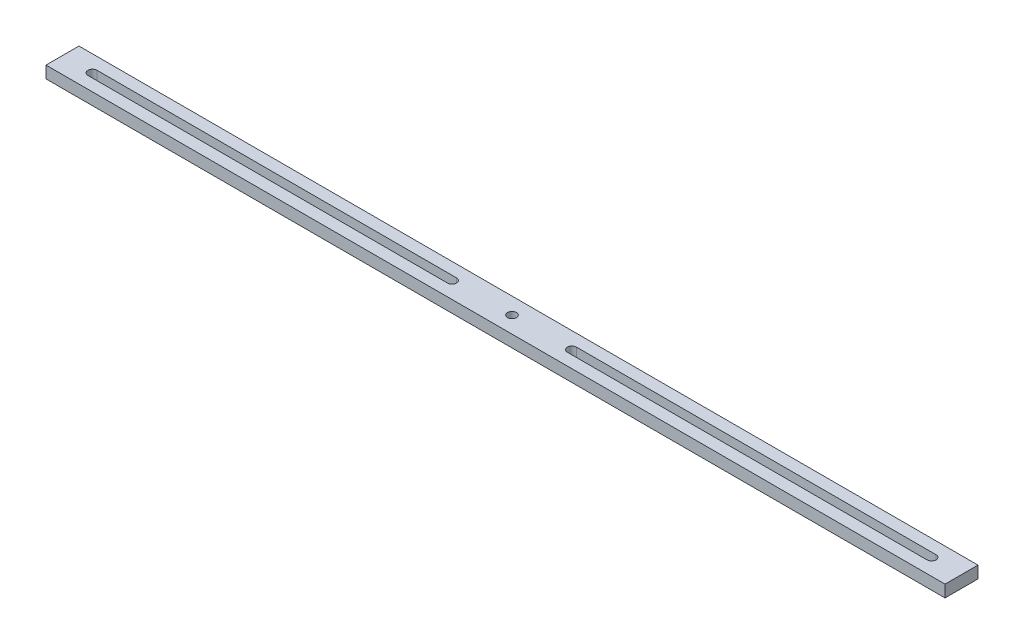
ISO-10303-21;
HEADER;
FILE_DESCRIPTION(('STEP AP214'),'2;1');
FILE_NAME('part.step','',(''),(''),'','','');
FILE_SCHEMA(('AUTOMOTIVE_DESIGN { 1 0 10303 214 1 1 1 1 }'));
ENDSEC;
DATA;
#1=APPLICATION_CONTEXT('core data for automotive mechanical design processes');
#2=APPLICATION_PROTOCOL_DEFINITION('international standard','automotive_design',2000,#1);
#3=PRODUCT_CONTEXT('',#1,'mechanical');
#4=PRODUCT('Part','Part','',(#3));
#5=PRODUCT_RELATED_PRODUCT_CATEGORY('part','',(#4));
#6=PRODUCT_DEFINITION_FORMATION('','',#4);
#7=PRODUCT_DEFINITION_CONTEXT('part definition',#1,'design');
#8=PRODUCT_DEFINITION('design','',#6,#7);
#9=PRODUCT_DEFINITION_SHAPE('','',#8);
#10=(LENGTH_UNIT() NAMED_UNIT(*) SI_UNIT(.MILLI.,.METRE.));
#11=(NAMED_UNIT(*) PLANE_ANGLE_UNIT() SI_UNIT($,.RADIAN.));
#12=(NAMED_UNIT(*) SI_UNIT($,.STERADIAN.) SOLID_ANGLE_UNIT());
#13=UNCERTAINTY_MEASURE_WITH_UNIT(LENGTH_MEASURE(1.E-05),#10,'distance_accuracy_value','');
#14=(GEOMETRIC_REPRESENTATION_CONTEXT(3) GLOBAL_UNCERTAINTY_ASSIGNED_CONTEXT((#13)) GLOBAL_UNIT_ASSIGNED_CONTEXT((#10,
#11,#12)) REPRESENTATION_CONTEXT('',''));
#15=CARTESIAN_POINT('',(0.,0.,0.));
#16=DIRECTION('',(0.,0.,1.));
#17=DIRECTION('',(1.,0.,0.));
#18=AXIS2_PLACEMENT_3D('',#15,#16,#17);
#19=CARTESIAN_POINT('',(0.,4.,0.));
#20=DIRECTION('',(0.,1.,0.));
#21=DIRECTION('',(0.,0.,1.));
#22=AXIS2_PLACEMENT_3D('',#19,#20,#21);
#23=PLANE('',#22);
#24=DIRECTION('',(1.,0.,0.));
#25=VECTOR('',#24,1.);
#26=CARTESIAN_POINT('',(-20.0000000000004,4.,1.50000000000002));
#27=LINE('',#26,#25);
#28=CARTESIAN_POINT('',(-140.,4.,1.50000000000002));
#29=VERTEX_POINT('',#28);
#30=CARTESIAN_POINT('',(-20.0000000000004,4.,1.50000000000002));
#31=VERTEX_POINT('',#30);
#32=EDGE_CURVE('E130',#29,#31,#27,.T.);
#33=ORIENTED_EDGE('',*,*,#32,.F.);
#34=CARTESIAN_POINT('',(-140.,4.,0.));
#35=DIRECTION('',(0.,1.,0.));
#36=DIRECTION('',(0.,0.,-1.));
#37=AXIS2_PLACEMENT_3D('',#34,#35,#36);
#38=CIRCLE('',#37,1.5);
#39=CARTESIAN_POINT('',(-140.,4.,-1.49999999999998));
#40=VERTEX_POINT('',#39);
#41=EDGE_CURVE('E122',#40,#29,#38,.T.);
#42=ORIENTED_EDGE('',*,*,#41,.F.);
#43=DIRECTION('',(-1.,0.,0.));
#44=VECTOR('',#43,1.);
#45=CARTESIAN_POINT('',(-20.0000000000004,4.,-1.49999999999998));
#46=LINE('',#45,#44);
#47=CARTESIAN_POINT('',(-20.0000000000004,4.,-1.49999999999998));
#48=VERTEX_POINT('',#47);
#49=EDGE_CURVE('E145',#48,#40,#46,.T.);
#50=ORIENTED_EDGE('',*,*,#49,.F.);
#51=CARTESIAN_POINT('',(-20.0000000000004,4.,0.));
#52=DIRECTION('',(0.,1.,0.));
#53=DIRECTION('',(0.,0.,-1.));
#54=AXIS2_PLACEMENT_3D('',#51,#52,#53);
#55=CIRCLE('',#54,1.5);
#56=EDGE_CURVE('E143',#31,#48,#55,.T.);
#57=ORIENTED_EDGE('',*,*,#56,.F.);
#58=EDGE_LOOP('',(#33,#42,#50,#57));
#59=FACE_BOUND('',#58,.T.);
#60=DIRECTION('',(-1.,0.,0.));
#61=VECTOR('',#60,1.);
#62=CARTESIAN_POINT('',(20.0000000000004,4.,-1.49999999999998));
#63=LINE('',#62,#61);
#64=CARTESIAN_POINT('',(140.,4.,-1.49999999999998));
#65=VERTEX_POINT('',#64);
#66=CARTESIAN_POINT('',(20.0000000000004,4.,-1.49999999999998));
#67=VERTEX_POINT('',#66);
#68=EDGE_CURVE('E163',#65,#67,#63,.T.);
#69=ORIENTED_EDGE('',*,*,#68,.F.);
#70=CARTESIAN_POINT('',(140.,4.,0.));
#71=DIRECTION('',(0.,1.,0.));
#72=DIRECTION('',(0.,0.,1.));
#73=AXIS2_PLACEMENT_3D('',#70,#71,#72);
#74=CIRCLE('',#73,1.5);
#75=CARTESIAN_POINT('',(140.,4.,1.50000000000002));
#76=VERTEX_POINT('',#75);
#77=EDGE_CURVE('E161',#76,#65,#74,.T.);
#78=ORIENTED_EDGE('',*,*,#77,.F.);
#79=DIRECTION('',(1.,0.,0.));
#80=VECTOR('',#79,1.);
#81=CARTESIAN_POINT('',(20.0000000000004,4.,1.50000000000002));
#82=LINE('',#81,#80);
#83=CARTESIAN_POINT('',(20.0000000000004,4.,1.50000000000002));
#84=VERTEX_POINT('',#83);
#85=EDGE_CURVE('E169',#84,#76,#82,.T.);
#86=ORIENTED_EDGE('',*,*,#85,.F.);
#87=CARTESIAN_POINT('',(20.0000000000004,4.,0.));
#88=DIRECTION('',(0.,1.,0.));
#89=DIRECTION('',(0.,0.,1.));
#90=AXIS2_PLACEMENT_3D('',#87,#88,#89);
#91=CIRCLE('',#90,1.5);
#92=EDGE_CURVE('E166',#67,#84,#91,.T.);
#93=ORIENTED_EDGE('',*,*,#92,.F.);
#94=EDGE_LOOP('',(#69,#78,#86,#93));
#95=FACE_BOUND('',#94,.T.);
#96=DIRECTION('',(0.,0.,-1.));
#97=VECTOR('',#96,1.);
#98=CARTESIAN_POINT('',(150.,4.,-5.49999999999998));
#99=LINE('',#98,#97);
#100=CARTESIAN_POINT('',(150.,4.,5.50000000000002));
#101=VERTEX_POINT('',#100);
#102=CARTESIAN_POINT('',(150.,4.,-5.49999999999998));
#103=VERTEX_POINT('',#102);
#104=EDGE_CURVE('E192',#101,#103,#99,.T.);
#105=ORIENTED_EDGE('',*,*,#104,.T.);
#106=DIRECTION('',(-1.,0.,0.));
#107=VECTOR('',#106,1.);
#108=CARTESIAN_POINT('',(-150.,4.,-5.49999999999998));
#109=LINE('',#108,#107);
#110=CARTESIAN_POINT('',(-150.,4.,-5.49999999999998));
#111=VERTEX_POINT('',#110);
#112=EDGE_CURVE('E195',#103,#111,#109,.T.);
#113=ORIENTED_EDGE('',*,*,#112,.T.);
#114=DIRECTION('',(0.,0.,1.));
#115=VECTOR('',#114,1.);
#116=CARTESIAN_POINT('',(-150.,4.,-5.49999999999998));
#117=LINE('',#116,#115);
#118=CARTESIAN_POINT('',(-150.,4.,5.50000000000002));
#119=VERTEX_POINT('',#118);
#120=EDGE_CURVE('E198',#111,#119,#117,.T.);
#121=ORIENTED_EDGE('',*,*,#120,.T.);
#122=DIRECTION('',(1.,0.,0.));
#123=VECTOR('',#122,1.);
#124=CARTESIAN_POINT('',(-150.,4.,5.50000000000002));
#125=LINE('',#124,#123);
#126=EDGE_CURVE('E200',#119,#101,#125,.T.);
#127=ORIENTED_EDGE('',*,*,#126,.T.);
#128=EDGE_LOOP('',(#105,#113,#121,#127));
#129=FACE_BOUND('',#128,.T.);
#130=CARTESIAN_POINT('',(4.44089209850063E-13,4.,0.));
#131=DIRECTION('',(0.,1.,0.));
#132=DIRECTION('',(0.,0.,1.));
#133=AXIS2_PLACEMENT_3D('',#130,#131,#132);
#134=CIRCLE('',#133,1.5);
#135=CARTESIAN_POINT('',(4.44089209850063E-13,4.,1.50000000000002));
#136=VERTEX_POINT('',#135);
#137=EDGE_CURVE('E151',#136,#136,#134,.T.);
#138=ORIENTED_EDGE('',*,*,#137,.F.);
#139=EDGE_LOOP('',(#138));
#140=FACE_BOUND('',#139,.T.);
#141=ADVANCED_FACE('F33',(#59,#95,#129,#140),#23,.T.);
#142=CARTESIAN_POINT('',(0.,0.,0.));
#143=DIRECTION('',(0.,1.,0.));
#144=DIRECTION('',(0.,0.,1.));
#145=AXIS2_PLACEMENT_3D('',#142,#143,#144);
#146=PLANE('',#145);
#147=CARTESIAN_POINT('',(140.,0.,0.));
#148=DIRECTION('',(0.,1.,0.));
#149=DIRECTION('',(0.,0.,1.));
#150=AXIS2_PLACEMENT_3D('',#147,#148,#149);
#151=CIRCLE('',#150,1.5);
#152=CARTESIAN_POINT('',(140.,0.,1.50000000000002));
#153=VERTEX_POINT('',#152);
#154=CARTESIAN_POINT('',(140.,0.,-1.49999999999998));
#155=VERTEX_POINT('',#154);
#156=EDGE_CURVE('E138',#153,#155,#151,.T.);
#157=ORIENTED_EDGE('',*,*,#156,.T.);
#158=DIRECTION('',(-1.,0.,0.));
#159=VECTOR('',#158,1.);
#160=CARTESIAN_POINT('',(20.0000000000004,0.,-1.49999999999998));
#161=LINE('',#160,#159);
#162=CARTESIAN_POINT('',(20.0000000000004,0.,-1.49999999999998));
#163=VERTEX_POINT('',#162);
#164=EDGE_CURVE('E174',#155,#163,#161,.T.);
#165=ORIENTED_EDGE('',*,*,#164,.T.);
#166=CARTESIAN_POINT('',(20.0000000000004,0.,0.));
#167=DIRECTION('',(0.,1.,0.));
#168=DIRECTION('',(0.,0.,1.));
#169=AXIS2_PLACEMENT_3D('',#166,#167,#168);
#170=CIRCLE('',#169,1.5);
#171=CARTESIAN_POINT('',(20.0000000000004,0.,1.50000000000002));
#172=VERTEX_POINT('',#171);
#173=EDGE_CURVE('E177',#163,#172,#170,.T.);
#174=ORIENTED_EDGE('',*,*,#173,.T.);
#175=DIRECTION('',(1.,0.,0.));
#176=VECTOR('',#175,1.);
#177=CARTESIAN_POINT('',(20.0000000000004,0.,1.50000000000002));
#178=LINE('',#177,#176);
#179=EDGE_CURVE('E164',#172,#153,#178,.T.);
#180=ORIENTED_EDGE('',*,*,#179,.T.);
#181=EDGE_LOOP('',(#157,#165,#174,#180));
#182=FACE_BOUND('',#181,.T.);
#183=DIRECTION('',(0.,0.,-1.));
#184=VECTOR('',#183,1.);
#185=CARTESIAN_POINT('',(150.,0.,-5.49999999999998));
#186=LINE('',#185,#184);
#187=CARTESIAN_POINT('',(150.,0.,5.50000000000002));
#188=VERTEX_POINT('',#187);
#189=CARTESIAN_POINT('',(150.,0.,-5.49999999999998));
#190=VERTEX_POINT('',#189);
#191=EDGE_CURVE('E191',#188,#190,#186,.T.);
#192=ORIENTED_EDGE('',*,*,#191,.F.);
#193=DIRECTION('',(1.,0.,0.));
#194=VECTOR('',#193,1.);
#195=CARTESIAN_POINT('',(-150.,0.,5.50000000000002));
#196=LINE('',#195,#194);
#197=CARTESIAN_POINT('',(-150.,0.,5.50000000000002));
#198=VERTEX_POINT('',#197);
#199=EDGE_CURVE('E196',#198,#188,#196,.T.);
#200=ORIENTED_EDGE('',*,*,#199,.F.);
#201=DIRECTION('',(0.,0.,1.));
#202=VECTOR('',#201,1.);
#203=CARTESIAN_POINT('',(-150.,0.,-5.49999999999998));
#204=LINE('',#203,#202);
#205=CARTESIAN_POINT('',(-150.,0.,-5.49999999999998));
#206=VERTEX_POINT('',#205);
#207=EDGE_CURVE('E207',#206,#198,#204,.T.);
#208=ORIENTED_EDGE('',*,*,#207,.F.);
#209=DIRECTION('',(-1.,0.,0.));
#210=VECTOR('',#209,1.);
#211=CARTESIAN_POINT('',(-150.,0.,-5.49999999999998));
#212=LINE('',#211,#210);
#213=EDGE_CURVE('E205',#190,#206,#212,.T.);
#214=ORIENTED_EDGE('',*,*,#213,.F.);
#215=EDGE_LOOP('',(#192,#200,#208,#214));
#216=FACE_BOUND('',#215,.T.);
#217=CARTESIAN_POINT('',(-140.,0.,0.));
#218=DIRECTION('',(0.,1.,0.));
#219=DIRECTION('',(0.,0.,-1.));
#220=AXIS2_PLACEMENT_3D('',#217,#218,#219);
#221=CIRCLE('',#220,1.5);
#222=CARTESIAN_POINT('',(-140.,0.,-1.49999999999998));
#223=VERTEX_POINT('',#222);
#224=CARTESIAN_POINT('',(-140.,0.,1.50000000000002));
#225=VERTEX_POINT('',#224);
#226=EDGE_CURVE('E56',#223,#225,#221,.T.);
#227=ORIENTED_EDGE('',*,*,#226,.T.);
#228=DIRECTION('',(1.,0.,0.));
#229=VECTOR('',#228,1.);
#230=CARTESIAN_POINT('',(-20.0000000000004,0.,1.50000000000002));
#231=LINE('',#230,#229);
#232=CARTESIAN_POINT('',(-20.0000000000004,0.,1.50000000000002));
#233=VERTEX_POINT('',#232);
#234=EDGE_CURVE('E137',#225,#233,#231,.T.);
#235=ORIENTED_EDGE('',*,*,#234,.T.);
#236=CARTESIAN_POINT('',(-20.0000000000004,0.,0.));
#237=DIRECTION('',(0.,1.,0.));
#238=DIRECTION('',(0.,0.,-1.));
#239=AXIS2_PLACEMENT_3D('',#236,#237,#238);
#240=CIRCLE('',#239,1.5);
#241=CARTESIAN_POINT('',(-20.0000000000004,0.,-1.49999999999998));
#242=VERTEX_POINT('',#241);
#243=EDGE_CURVE('E153',#233,#242,#240,.T.);
#244=ORIENTED_EDGE('',*,*,#243,.T.);
#245=DIRECTION('',(-1.,0.,0.));
#246=VECTOR('',#245,1.);
#247=CARTESIAN_POINT('',(-20.0000000000004,0.,-1.49999999999998));
#248=LINE('',#247,#246);
#249=EDGE_CURVE('E131',#242,#223,#248,.T.);
#250=ORIENTED_EDGE('',*,*,#249,.T.);
#251=EDGE_LOOP('',(#227,#235,#244,#250));
#252=FACE_BOUND('',#251,.T.);
#253=CARTESIAN_POINT('',(4.44089209850063E-13,0.,0.));
#254=DIRECTION('',(0.,1.,0.));
#255=DIRECTION('',(0.,0.,1.));
#256=AXIS2_PLACEMENT_3D('',#253,#254,#255);
#257=CIRCLE('',#256,1.5);
#258=CARTESIAN_POINT('',(4.44089209850063E-13,0.,1.50000000000002));
#259=VERTEX_POINT('',#258);
#260=EDGE_CURVE('E305',#259,#259,#257,.T.);
#261=ORIENTED_EDGE('',*,*,#260,.T.);
#262=EDGE_LOOP('',(#261));
#263=FACE_BOUND('',#262,.T.);
#264=ADVANCED_FACE('F225',(#182,#216,#252,#263),#146,.F.);
#265=CARTESIAN_POINT('',(150.,4.,-5.49999999999998));
#266=DIRECTION('',(-1.,0.,0.));
#267=DIRECTION('',(0.,0.,1.));
#268=AXIS2_PLACEMENT_3D('',#265,#266,#267);
#269=PLANE('',#268);
#270=ORIENTED_EDGE('',*,*,#191,.T.);
#271=DIRECTION('',(0.,-1.,0.));
#272=VECTOR('',#271,1.);
#273=CARTESIAN_POINT('',(150.,4.,-5.49999999999998));
#274=LINE('',#273,#272);
#275=EDGE_CURVE('E11',#103,#190,#274,.T.);
#276=ORIENTED_EDGE('',*,*,#275,.F.);
#277=ORIENTED_EDGE('',*,*,#104,.F.);
#278=DIRECTION('',(0.,-1.,0.));
#279=VECTOR('',#278,1.);
#280=CARTESIAN_POINT('',(150.,4.,5.50000000000002));
#281=LINE('',#280,#279);
#282=EDGE_CURVE('E202',#101,#188,#281,.T.);
#283=ORIENTED_EDGE('',*,*,#282,.T.);
#284=EDGE_LOOP('',(#270,#276,#277,#283));
#285=FACE_BOUND('',#284,.T.);
#286=ADVANCED_FACE('F35',(#285),#269,.F.);
#287=CARTESIAN_POINT('',(-150.,4.,-5.49999999999998));
#288=DIRECTION('',(0.,0.,1.));
#289=DIRECTION('',(1.,0.,0.));
#290=AXIS2_PLACEMENT_3D('',#287,#288,#289);
#291=PLANE('',#290);
#292=ORIENTED_EDGE('',*,*,#213,.T.);
#293=DIRECTION('',(0.,-1.,0.));
#294=VECTOR('',#293,1.);
#295=CARTESIAN_POINT('',(-150.,4.,-5.49999999999998));
#296=LINE('',#295,#294);
#297=EDGE_CURVE('E41',#111,#206,#296,.T.);
#298=ORIENTED_EDGE('',*,*,#297,.F.);
#299=ORIENTED_EDGE('',*,*,#112,.F.);
#300=ORIENTED_EDGE('',*,*,#275,.T.);
#301=EDGE_LOOP('',(#292,#298,#299,#300));
#302=FACE_BOUND('',#301,.T.);
#303=ADVANCED_FACE('F236',(#302),#291,.F.);
#304=CARTESIAN_POINT('',(-150.,4.,-5.49999999999998));
#305=DIRECTION('',(1.,0.,0.));
#306=DIRECTION('',(0.,0.,-1.));
#307=AXIS2_PLACEMENT_3D('',#304,#305,#306);
#308=PLANE('',#307);
#309=ORIENTED_EDGE('',*,*,#207,.T.);
#310=DIRECTION('',(0.,-1.,0.));
#311=VECTOR('',#310,1.);
#312=CARTESIAN_POINT('',(-150.,4.,5.50000000000002));
#313=LINE('',#312,#311);
#314=EDGE_CURVE('E212',#119,#198,#313,.T.);
#315=ORIENTED_EDGE('',*,*,#314,.F.);
#316=ORIENTED_EDGE('',*,*,#120,.F.);
#317=ORIENTED_EDGE('',*,*,#297,.T.);
#318=EDGE_LOOP('',(#309,#315,#316,#317));
#319=FACE_BOUND('',#318,.T.);
#320=ADVANCED_FACE('F219',(#319),#308,.F.);
#321=CARTESIAN_POINT('',(-150.,4.,5.50000000000002));
#322=DIRECTION('',(0.,0.,-1.));
#323=DIRECTION('',(-1.,0.,0.));
#324=AXIS2_PLACEMENT_3D('',#321,#322,#323);
#325=PLANE('',#324);
#326=ORIENTED_EDGE('',*,*,#199,.T.);
#327=ORIENTED_EDGE('',*,*,#282,.F.);
#328=ORIENTED_EDGE('',*,*,#126,.F.);
#329=ORIENTED_EDGE('',*,*,#314,.T.);
#330=EDGE_LOOP('',(#326,#327,#328,#329));
#331=FACE_BOUND('',#330,.T.);
#332=ADVANCED_FACE('F229',(#331),#325,.F.);
#333=CARTESIAN_POINT('',(140.,4.,0.));
#334=DIRECTION('',(0.,-1.,0.));
#335=DIRECTION('',(0.,0.,-1.));
#336=AXIS2_PLACEMENT_3D('',#333,#334,#335);
#337=CYLINDRICAL_SURFACE('',#336,1.5);
#338=ORIENTED_EDGE('',*,*,#156,.F.);
#339=DIRECTION('',(0.,-1.,0.));
#340=VECTOR('',#339,1.);
#341=CARTESIAN_POINT('',(140.,4.,1.50000000000002));
#342=LINE('',#341,#340);
#343=EDGE_CURVE('E171',#76,#153,#342,.T.);
#344=ORIENTED_EDGE('',*,*,#343,.F.);
#345=ORIENTED_EDGE('',*,*,#77,.T.);
#346=DIRECTION('',(0.,-1.,0.));
#347=VECTOR('',#346,1.);
#348=CARTESIAN_POINT('',(140.,4.,-1.49999999999998));
#349=LINE('',#348,#347);
#350=EDGE_CURVE('E188',#65,#155,#349,.T.);
#351=ORIENTED_EDGE('',*,*,#350,.T.);
#352=EDGE_LOOP('',(#338,#344,#345,#351));
#353=FACE_BOUND('',#352,.T.);
#354=ADVANCED_FACE('F251',(#353),#337,.F.);
#355=CARTESIAN_POINT('',(20.0000000000004,4.,-1.49999999999998));
#356=DIRECTION('',(0.,0.,1.));
#357=DIRECTION('',(1.,0.,0.));
#358=AXIS2_PLACEMENT_3D('',#355,#356,#357);
#359=PLANE('',#358);
#360=ORIENTED_EDGE('',*,*,#164,.F.);
#361=ORIENTED_EDGE('',*,*,#350,.F.);
#362=ORIENTED_EDGE('',*,*,#68,.T.);
#363=DIRECTION('',(0.,-1.,0.));
#364=VECTOR('',#363,1.);
#365=CARTESIAN_POINT('',(20.0000000000004,4.,-1.49999999999998));
#366=LINE('',#365,#364);
#367=EDGE_CURVE('E186',#67,#163,#366,.T.);
#368=ORIENTED_EDGE('',*,*,#367,.T.);
#369=EDGE_LOOP('',(#360,#361,#362,#368));
#370=FACE_BOUND('',#369,.T.);
#371=ADVANCED_FACE('F258',(#370),#359,.T.);
#372=CARTESIAN_POINT('',(20.0000000000004,4.,0.));
#373=DIRECTION('',(0.,-1.,0.));
#374=DIRECTION('',(0.,0.,-1.));
#375=AXIS2_PLACEMENT_3D('',#372,#373,#374);
#376=CYLINDRICAL_SURFACE('',#375,1.5);
#377=ORIENTED_EDGE('',*,*,#173,.F.);
#378=ORIENTED_EDGE('',*,*,#367,.F.);
#379=ORIENTED_EDGE('',*,*,#92,.T.);
#380=DIRECTION('',(0.,-1.,0.));
#381=VECTOR('',#380,1.);
#382=CARTESIAN_POINT('',(20.0000000000004,4.,1.50000000000002));
#383=LINE('',#382,#381);
#384=EDGE_CURVE('E184',#84,#172,#383,.T.);
#385=ORIENTED_EDGE('',*,*,#384,.T.);
#386=EDGE_LOOP('',(#377,#378,#379,#385));
#387=FACE_BOUND('',#386,.T.);
#388=ADVANCED_FACE('F263',(#387),#376,.F.);
#389=CARTESIAN_POINT('',(20.0000000000004,4.,1.50000000000002));
#390=DIRECTION('',(0.,0.,-1.));
#391=DIRECTION('',(-1.,0.,0.));
#392=AXIS2_PLACEMENT_3D('',#389,#390,#391);
#393=PLANE('',#392);
#394=ORIENTED_EDGE('',*,*,#179,.F.);
#395=ORIENTED_EDGE('',*,*,#384,.F.);
#396=ORIENTED_EDGE('',*,*,#85,.T.);
#397=ORIENTED_EDGE('',*,*,#343,.T.);
#398=EDGE_LOOP('',(#394,#395,#396,#397));
#399=FACE_BOUND('',#398,.T.);
#400=ADVANCED_FACE('F270',(#399),#393,.T.);
#401=CARTESIAN_POINT('',(-140.,4.,0.));
#402=DIRECTION('',(0.,-1.,0.));
#403=DIRECTION('',(0.,0.,-1.));
#404=AXIS2_PLACEMENT_3D('',#401,#402,#403);
#405=CYLINDRICAL_SURFACE('',#404,1.5);
#406=ORIENTED_EDGE('',*,*,#226,.F.);
#407=DIRECTION('',(0.,-1.,0.));
#408=VECTOR('',#407,1.);
#409=CARTESIAN_POINT('',(-140.,4.,-1.49999999999998));
#410=LINE('',#409,#408);
#411=EDGE_CURVE('E126',#40,#223,#410,.T.);
#412=ORIENTED_EDGE('',*,*,#411,.F.);
#413=ORIENTED_EDGE('',*,*,#41,.T.);
#414=DIRECTION('',(0.,-1.,0.));
#415=VECTOR('',#414,1.);
#416=CARTESIAN_POINT('',(-140.,4.,1.50000000000002));
#417=LINE('',#416,#415);
#418=EDGE_CURVE('E125',#29,#225,#417,.T.);
#419=ORIENTED_EDGE('',*,*,#418,.T.);
#420=EDGE_LOOP('',(#406,#412,#413,#419));
#421=FACE_BOUND('',#420,.T.);
#422=ADVANCED_FACE('F124',(#421),#405,.F.);
#423=CARTESIAN_POINT('',(-20.0000000000004,4.,1.50000000000002));
#424=DIRECTION('',(0.,0.,-1.));
#425=DIRECTION('',(-1.,0.,0.));
#426=AXIS2_PLACEMENT_3D('',#423,#424,#425);
#427=PLANE('',#426);
#428=ORIENTED_EDGE('',*,*,#234,.F.);
#429=ORIENTED_EDGE('',*,*,#418,.F.);
#430=ORIENTED_EDGE('',*,*,#32,.T.);
#431=DIRECTION('',(0.,-1.,0.));
#432=VECTOR('',#431,1.);
#433=CARTESIAN_POINT('',(-20.0000000000004,4.,1.50000000000002));
#434=LINE('',#433,#432);
#435=EDGE_CURVE('E139',#31,#233,#434,.T.);
#436=ORIENTED_EDGE('',*,*,#435,.T.);
#437=EDGE_LOOP('',(#428,#429,#430,#436));
#438=FACE_BOUND('',#437,.T.);
#439=ADVANCED_FACE('F134',(#438),#427,.T.);
#440=CARTESIAN_POINT('',(-20.0000000000004,4.,0.));
#441=DIRECTION('',(0.,-1.,0.));
#442=DIRECTION('',(0.,0.,-1.));
#443=AXIS2_PLACEMENT_3D('',#440,#441,#442);
#444=CYLINDRICAL_SURFACE('',#443,1.5);
#445=ORIENTED_EDGE('',*,*,#243,.F.);
#446=ORIENTED_EDGE('',*,*,#435,.F.);
#447=ORIENTED_EDGE('',*,*,#56,.T.);
#448=DIRECTION('',(0.,-1.,0.));
#449=VECTOR('',#448,1.);
#450=CARTESIAN_POINT('',(-20.0000000000004,4.,-1.49999999999998));
#451=LINE('',#450,#449);
#452=EDGE_CURVE('E48',#48,#242,#451,.T.);
#453=ORIENTED_EDGE('',*,*,#452,.T.);
#454=EDGE_LOOP('',(#445,#446,#447,#453));
#455=FACE_BOUND('',#454,.T.);
#456=ADVANCED_FACE('F288',(#455),#444,.F.);
#457=CARTESIAN_POINT('',(-20.0000000000004,4.,-1.49999999999998));
#458=DIRECTION('',(0.,0.,1.));
#459=DIRECTION('',(1.,0.,0.));
#460=AXIS2_PLACEMENT_3D('',#457,#458,#459);
#461=PLANE('',#460);
#462=ORIENTED_EDGE('',*,*,#249,.F.);
#463=ORIENTED_EDGE('',*,*,#452,.F.);
#464=ORIENTED_EDGE('',*,*,#49,.T.);
#465=ORIENTED_EDGE('',*,*,#411,.T.);
#466=EDGE_LOOP('',(#462,#463,#464,#465));
#467=FACE_BOUND('',#466,.T.);
#468=ADVANCED_FACE('F291',(#467),#461,.T.);
#469=CARTESIAN_POINT('',(4.44089209850063E-13,4.,0.));
#470=DIRECTION('',(0.,-1.,0.));
#471=DIRECTION('',(0.,0.,-1.));
#472=AXIS2_PLACEMENT_3D('',#469,#470,#471);
#473=CYLINDRICAL_SURFACE('',#472,1.5);
#474=ORIENTED_EDGE('',*,*,#137,.T.);
#475=EDGE_LOOP('',(#474));
#476=FACE_BOUND('',#475,.T.);
#477=ORIENTED_EDGE('',*,*,#260,.F.);
#478=EDGE_LOOP('',(#477));
#479=FACE_BOUND('',#478,.T.);
#480=ADVANCED_FACE('F295',(#476,#479),#473,.F.);
#481=CLOSED_SHELL('',(#141,#264,#286,#303,#320,#332,#354,#371,#388,#400,#422,#439,#456,#468,#480));
#482=MANIFOLD_SOLID_BREP('B2',#481);
#483=ADVANCED_BREP_SHAPE_REPRESENTATION('',(#18,#482),#14);
#484=SHAPE_DEFINITION_REPRESENTATION(#9,#483);
ENDSEC;
END-ISO-10303-21;
